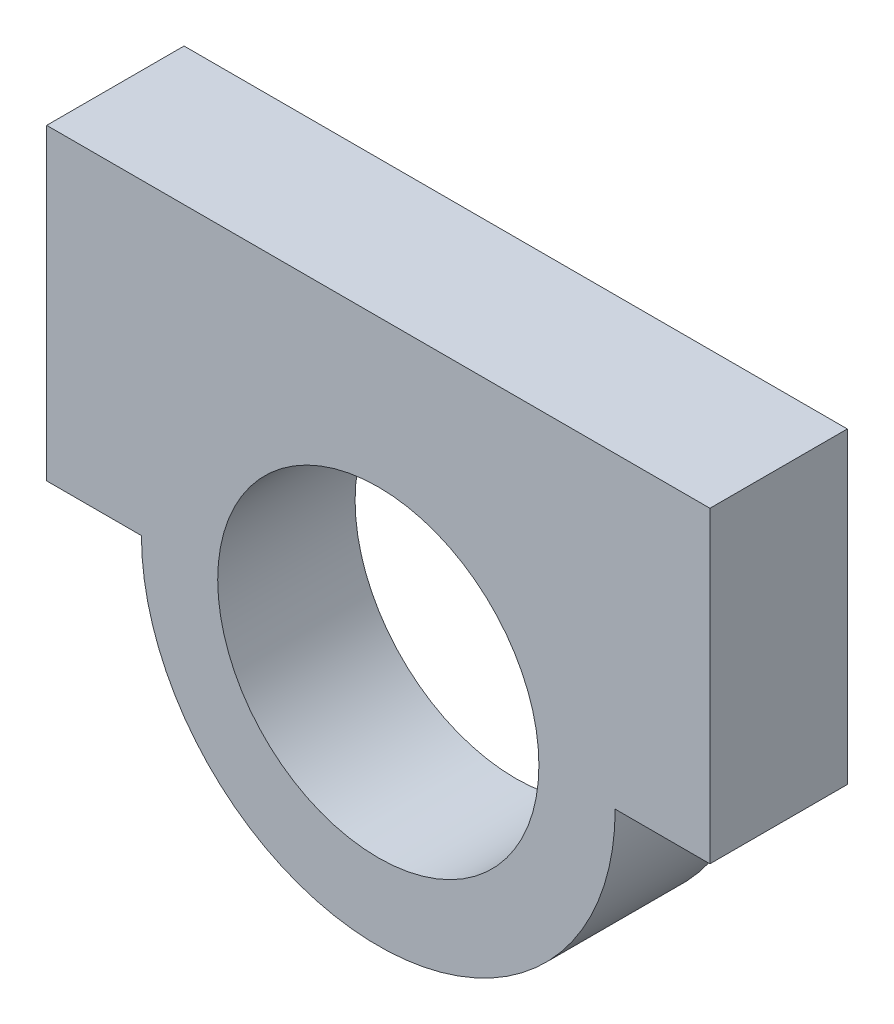
ISO-10303-21;
HEADER;
FILE_DESCRIPTION(('STEP AP214'),'2;1');
FILE_NAME('part.step','',(''),(''),'','','');
FILE_SCHEMA(('AUTOMOTIVE_DESIGN { 1 0 10303 214 1 1 1 1 }'));
ENDSEC;
DATA;
#1=APPLICATION_CONTEXT('core data for automotive mechanical design processes');
#2=APPLICATION_PROTOCOL_DEFINITION('international standard','automotive_design',2000,#1);
#3=PRODUCT_CONTEXT('',#1,'mechanical');
#4=PRODUCT('Part','Part','',(#3));
#5=PRODUCT_RELATED_PRODUCT_CATEGORY('part','',(#4));
#6=PRODUCT_DEFINITION_FORMATION('','',#4);
#7=PRODUCT_DEFINITION_CONTEXT('part definition',#1,'design');
#8=PRODUCT_DEFINITION('design','',#6,#7);
#9=PRODUCT_DEFINITION_SHAPE('','',#8);
#10=(LENGTH_UNIT() NAMED_UNIT(*) SI_UNIT(.MILLI.,.METRE.));
#11=(NAMED_UNIT(*) PLANE_ANGLE_UNIT() SI_UNIT($,.RADIAN.));
#12=(NAMED_UNIT(*) SI_UNIT($,.STERADIAN.) SOLID_ANGLE_UNIT());
#13=UNCERTAINTY_MEASURE_WITH_UNIT(LENGTH_MEASURE(1.E-05),#10,'distance_accuracy_value','');
#14=(GEOMETRIC_REPRESENTATION_CONTEXT(3) GLOBAL_UNCERTAINTY_ASSIGNED_CONTEXT((#13)) GLOBAL_UNIT_ASSIGNED_CONTEXT((#10,
#11,#12)) REPRESENTATION_CONTEXT('',''));
#15=CARTESIAN_POINT('',(0.,0.,0.));
#16=DIRECTION('',(0.,0.,1.));
#17=DIRECTION('',(1.,0.,0.));
#18=AXIS2_PLACEMENT_3D('',#15,#16,#17);
#19=CARTESIAN_POINT('',(0.,0.,29.));
#20=DIRECTION('',(0.,0.,-1.));
#21=DIRECTION('',(-1.,0.,0.));
#22=AXIS2_PLACEMENT_3D('',#19,#20,#21);
#23=CYLINDRICAL_SURFACE('',#22,50.);
#24=CARTESIAN_POINT('',(0.,0.,0.));
#25=DIRECTION('',(0.,0.,1.));
#26=DIRECTION('',(1.,0.,0.));
#27=AXIS2_PLACEMENT_3D('',#24,#25,#26);
#28=CIRCLE('',#27,50.);
#29=CARTESIAN_POINT('',(-50.,0.,0.));
#30=VERTEX_POINT('',#29);
#31=CARTESIAN_POINT('',(50.,0.,0.));
#32=VERTEX_POINT('',#31);
#33=EDGE_CURVE('E121',#30,#32,#28,.T.);
#34=ORIENTED_EDGE('',*,*,#33,.T.);
#35=DIRECTION('',(0.,0.,-1.));
#36=VECTOR('',#35,1.);
#37=CARTESIAN_POINT('',(50.,0.,29.));
#38=LINE('',#37,#36);
#39=CARTESIAN_POINT('',(50.,0.,29.));
#40=VERTEX_POINT('',#39);
#41=EDGE_CURVE('E11',#40,#32,#38,.T.);
#42=ORIENTED_EDGE('',*,*,#41,.F.);
#43=CARTESIAN_POINT('',(0.,0.,29.));
#44=DIRECTION('',(0.,0.,1.));
#45=DIRECTION('',(1.,0.,0.));
#46=AXIS2_PLACEMENT_3D('',#43,#44,#45);
#47=CIRCLE('',#46,50.);
#48=CARTESIAN_POINT('',(-50.,0.,29.));
#49=VERTEX_POINT('',#48);
#50=EDGE_CURVE('E83',#49,#40,#47,.T.);
#51=ORIENTED_EDGE('',*,*,#50,.F.);
#52=DIRECTION('',(0.,0.,-1.));
#53=VECTOR('',#52,1.);
#54=CARTESIAN_POINT('',(-50.,0.,29.));
#55=LINE('',#54,#53);
#56=EDGE_CURVE('E52',#49,#30,#55,.T.);
#57=ORIENTED_EDGE('',*,*,#56,.T.);
#58=EDGE_LOOP('',(#34,#42,#51,#57));
#59=FACE_BOUND('',#58,.T.);
#60=ADVANCED_FACE('F35',(#59),#23,.T.);
#61=CARTESIAN_POINT('',(0.,0.,29.));
#62=DIRECTION('',(0.,-1.,0.));
#63=DIRECTION('',(1.,0.,0.));
#64=AXIS2_PLACEMENT_3D('',#61,#62,#63);
#65=PLANE('',#64);
#66=DIRECTION('',(-1.,0.,0.));
#67=VECTOR('',#66,1.);
#68=CARTESIAN_POINT('',(0.,0.,0.));
#69=LINE('',#68,#67);
#70=CARTESIAN_POINT('',(70.,0.,0.));
#71=VERTEX_POINT('',#70);
#72=EDGE_CURVE('E123',#71,#32,#69,.T.);
#73=ORIENTED_EDGE('',*,*,#72,.F.);
#74=DIRECTION('',(0.,0.,-1.));
#75=VECTOR('',#74,1.);
#76=CARTESIAN_POINT('',(70.,0.,29.));
#77=LINE('',#76,#75);
#78=CARTESIAN_POINT('',(70.,0.,29.));
#79=VERTEX_POINT('',#78);
#80=EDGE_CURVE('E44',#79,#71,#77,.T.);
#81=ORIENTED_EDGE('',*,*,#80,.F.);
#82=DIRECTION('',(-1.,0.,0.));
#83=VECTOR('',#82,1.);
#84=CARTESIAN_POINT('',(0.,0.,29.));
#85=LINE('',#84,#83);
#86=EDGE_CURVE('E229',#79,#40,#85,.T.);
#87=ORIENTED_EDGE('',*,*,#86,.T.);
#88=ORIENTED_EDGE('',*,*,#41,.T.);
#89=EDGE_LOOP('',(#73,#81,#87,#88));
#90=FACE_BOUND('',#89,.T.);
#91=ADVANCED_FACE('F144',(#90),#65,.T.);
#92=CARTESIAN_POINT('',(70.,0.,29.));
#93=DIRECTION('',(1.,0.,0.));
#94=DIRECTION('',(0.,1.,0.));
#95=AXIS2_PLACEMENT_3D('',#92,#93,#94);
#96=PLANE('',#95);
#97=DIRECTION('',(0.,-1.,0.));
#98=VECTOR('',#97,1.);
#99=CARTESIAN_POINT('',(70.,0.,0.));
#100=LINE('',#99,#98);
#101=CARTESIAN_POINT('',(70.,65.,0.));
#102=VERTEX_POINT('',#101);
#103=EDGE_CURVE('E126',#102,#71,#100,.T.);
#104=ORIENTED_EDGE('',*,*,#103,.F.);
#105=DIRECTION('',(0.,0.,-1.));
#106=VECTOR('',#105,1.);
#107=CARTESIAN_POINT('',(70.,65.,29.));
#108=LINE('',#107,#106);
#109=CARTESIAN_POINT('',(70.,65.,29.));
#110=VERTEX_POINT('',#109);
#111=EDGE_CURVE('E103',#110,#102,#108,.T.);
#112=ORIENTED_EDGE('',*,*,#111,.F.);
#113=DIRECTION('',(0.,-1.,0.));
#114=VECTOR('',#113,1.);
#115=CARTESIAN_POINT('',(70.,0.,29.));
#116=LINE('',#115,#114);
#117=EDGE_CURVE('E110',#110,#79,#116,.T.);
#118=ORIENTED_EDGE('',*,*,#117,.T.);
#119=ORIENTED_EDGE('',*,*,#80,.T.);
#120=EDGE_LOOP('',(#104,#112,#118,#119));
#121=FACE_BOUND('',#120,.T.);
#122=ADVANCED_FACE('F141',(#121),#96,.T.);
#123=CARTESIAN_POINT('',(0.,65.,29.));
#124=DIRECTION('',(0.,1.,0.));
#125=DIRECTION('',(0.,0.,1.));
#126=AXIS2_PLACEMENT_3D('',#123,#124,#125);
#127=PLANE('',#126);
#128=DIRECTION('',(1.,0.,0.));
#129=VECTOR('',#128,1.);
#130=CARTESIAN_POINT('',(0.,65.,0.));
#131=LINE('',#130,#129);
#132=CARTESIAN_POINT('',(-70.,65.,0.));
#133=VERTEX_POINT('',#132);
#134=EDGE_CURVE('E99',#133,#102,#131,.T.);
#135=ORIENTED_EDGE('',*,*,#134,.F.);
#136=DIRECTION('',(0.,0.,-1.));
#137=VECTOR('',#136,1.);
#138=CARTESIAN_POINT('',(-70.,65.,29.));
#139=LINE('',#138,#137);
#140=CARTESIAN_POINT('',(-70.,65.,29.));
#141=VERTEX_POINT('',#140);
#142=EDGE_CURVE('E94',#141,#133,#139,.T.);
#143=ORIENTED_EDGE('',*,*,#142,.F.);
#144=DIRECTION('',(1.,0.,0.));
#145=VECTOR('',#144,1.);
#146=CARTESIAN_POINT('',(0.,65.,29.));
#147=LINE('',#146,#145);
#148=EDGE_CURVE('E97',#141,#110,#147,.T.);
#149=ORIENTED_EDGE('',*,*,#148,.T.);
#150=ORIENTED_EDGE('',*,*,#111,.T.);
#151=EDGE_LOOP('',(#135,#143,#149,#150));
#152=FACE_BOUND('',#151,.T.);
#153=ADVANCED_FACE('F96',(#152),#127,.T.);
#154=CARTESIAN_POINT('',(-70.,0.,29.));
#155=DIRECTION('',(-1.,0.,0.));
#156=DIRECTION('',(0.,-1.,0.));
#157=AXIS2_PLACEMENT_3D('',#154,#155,#156);
#158=PLANE('',#157);
#159=DIRECTION('',(0.,1.,0.));
#160=VECTOR('',#159,1.);
#161=CARTESIAN_POINT('',(-70.,0.,0.));
#162=LINE('',#161,#160);
#163=CARTESIAN_POINT('',(-70.,0.,0.));
#164=VERTEX_POINT('',#163);
#165=EDGE_CURVE('E130',#164,#133,#162,.T.);
#166=ORIENTED_EDGE('',*,*,#165,.F.);
#167=DIRECTION('',(0.,0.,-1.));
#168=VECTOR('',#167,1.);
#169=CARTESIAN_POINT('',(-70.,0.,29.));
#170=LINE('',#169,#168);
#171=CARTESIAN_POINT('',(-70.,0.,29.));
#172=VERTEX_POINT('',#171);
#173=EDGE_CURVE('E71',#172,#164,#170,.T.);
#174=ORIENTED_EDGE('',*,*,#173,.F.);
#175=DIRECTION('',(0.,1.,0.));
#176=VECTOR('',#175,1.);
#177=CARTESIAN_POINT('',(-70.,0.,29.));
#178=LINE('',#177,#176);
#179=EDGE_CURVE('E108',#172,#141,#178,.T.);
#180=ORIENTED_EDGE('',*,*,#179,.T.);
#181=ORIENTED_EDGE('',*,*,#142,.T.);
#182=EDGE_LOOP('',(#166,#174,#180,#181));
#183=FACE_BOUND('',#182,.T.);
#184=ADVANCED_FACE('F112',(#183),#158,.T.);
#185=CARTESIAN_POINT('',(0.,0.,29.));
#186=DIRECTION('',(0.,0.,-1.));
#187=DIRECTION('',(-1.,0.,0.));
#188=AXIS2_PLACEMENT_3D('',#185,#186,#187);
#189=CYLINDRICAL_SURFACE('',#188,33.9);
#190=CARTESIAN_POINT('',(0.,0.,29.));
#191=DIRECTION('',(0.,0.,1.));
#192=DIRECTION('',(1.,0.,0.));
#193=AXIS2_PLACEMENT_3D('',#190,#191,#192);
#194=CIRCLE('',#193,33.9);
#195=CARTESIAN_POINT('',(33.9,0.,29.));
#196=VERTEX_POINT('',#195);
#197=EDGE_CURVE('E135',#196,#196,#194,.T.);
#198=ORIENTED_EDGE('',*,*,#197,.T.);
#199=EDGE_LOOP('',(#198));
#200=FACE_BOUND('',#199,.T.);
#201=CARTESIAN_POINT('',(0.,0.,0.));
#202=DIRECTION('',(0.,0.,1.));
#203=DIRECTION('',(1.,0.,0.));
#204=AXIS2_PLACEMENT_3D('',#201,#202,#203);
#205=CIRCLE('',#204,33.9);
#206=CARTESIAN_POINT('',(33.9,0.,0.));
#207=VERTEX_POINT('',#206);
#208=EDGE_CURVE('E118',#207,#207,#205,.T.);
#209=ORIENTED_EDGE('',*,*,#208,.F.);
#210=EDGE_LOOP('',(#209));
#211=FACE_BOUND('',#210,.T.);
#212=ADVANCED_FACE('F37',(#200,#211),#189,.F.);
#213=CARTESIAN_POINT('',(0.,0.,29.));
#214=DIRECTION('',(0.,-1.,0.));
#215=DIRECTION('',(1.,0.,0.));
#216=AXIS2_PLACEMENT_3D('',#213,#214,#215);
#217=PLANE('',#216);
#218=DIRECTION('',(-1.,0.,0.));
#219=VECTOR('',#218,1.);
#220=CARTESIAN_POINT('',(0.,0.,0.));
#221=LINE('',#220,#219);
#222=EDGE_CURVE('E132',#30,#164,#221,.T.);
#223=ORIENTED_EDGE('',*,*,#222,.F.);
#224=ORIENTED_EDGE('',*,*,#56,.F.);
#225=DIRECTION('',(-1.,0.,0.));
#226=VECTOR('',#225,1.);
#227=CARTESIAN_POINT('',(0.,0.,29.));
#228=LINE('',#227,#226);
#229=EDGE_CURVE('E113',#49,#172,#228,.T.);
#230=ORIENTED_EDGE('',*,*,#229,.T.);
#231=ORIENTED_EDGE('',*,*,#173,.T.);
#232=EDGE_LOOP('',(#223,#224,#230,#231));
#233=FACE_BOUND('',#232,.T.);
#234=ADVANCED_FACE('F147',(#233),#217,.T.);
#235=CARTESIAN_POINT('',(0.,0.,29.));
#236=DIRECTION('',(0.,0.,1.));
#237=DIRECTION('',(1.,0.,0.));
#238=AXIS2_PLACEMENT_3D('',#235,#236,#237);
#239=PLANE('',#238);
#240=ORIENTED_EDGE('',*,*,#197,.F.);
#241=EDGE_LOOP('',(#240));
#242=FACE_BOUND('',#241,.T.);
#243=ORIENTED_EDGE('',*,*,#50,.T.);
#244=ORIENTED_EDGE('',*,*,#86,.F.);
#245=ORIENTED_EDGE('',*,*,#117,.F.);
#246=ORIENTED_EDGE('',*,*,#148,.F.);
#247=ORIENTED_EDGE('',*,*,#179,.F.);
#248=ORIENTED_EDGE('',*,*,#229,.F.);
#249=EDGE_LOOP('',(#243,#244,#245,#246,#247,#248));
#250=FACE_BOUND('',#249,.T.);
#251=ADVANCED_FACE('F107',(#242,#250),#239,.T.);
#252=CARTESIAN_POINT('',(0.,0.,0.));
#253=DIRECTION('',(0.,0.,1.));
#254=DIRECTION('',(1.,0.,0.));
#255=AXIS2_PLACEMENT_3D('',#252,#253,#254);
#256=PLANE('',#255);
#257=ORIENTED_EDGE('',*,*,#208,.T.);
#258=EDGE_LOOP('',(#257));
#259=FACE_BOUND('',#258,.T.);
#260=ORIENTED_EDGE('',*,*,#33,.F.);
#261=ORIENTED_EDGE('',*,*,#222,.T.);
#262=ORIENTED_EDGE('',*,*,#165,.T.);
#263=ORIENTED_EDGE('',*,*,#134,.T.);
#264=ORIENTED_EDGE('',*,*,#103,.T.);
#265=ORIENTED_EDGE('',*,*,#72,.T.);
#266=EDGE_LOOP('',(#260,#261,#262,#263,#264,#265));
#267=FACE_BOUND('',#266,.T.);
#268=ADVANCED_FACE('F146',(#259,#267),#256,.F.);
#269=CLOSED_SHELL('',(#60,#91,#122,#153,#184,#212,#234,#251,#268));
#270=MANIFOLD_SOLID_BREP('B2',#269);
#271=ADVANCED_BREP_SHAPE_REPRESENTATION('',(#18,#270),#14);
#272=SHAPE_DEFINITION_REPRESENTATION(#9,#271);
ENDSEC;
END-ISO-10303-21;
